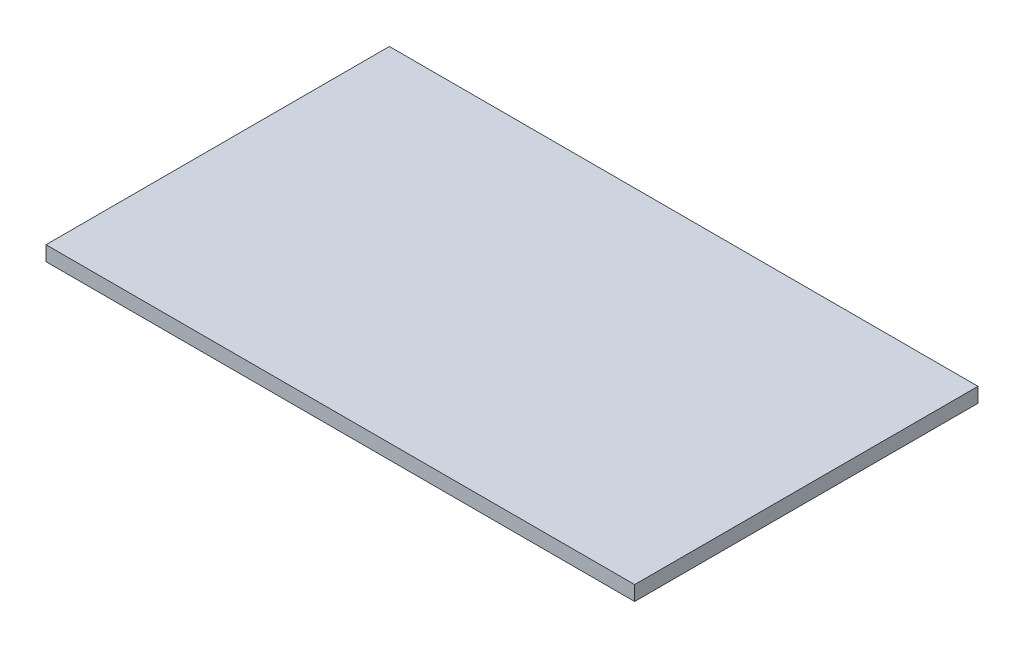
ISO-10303-21;
HEADER;
FILE_DESCRIPTION(('STEP AP214'),'2;1');
FILE_NAME('part.step','',(''),(''),'','','');
FILE_SCHEMA(('AUTOMOTIVE_DESIGN { 1 0 10303 214 1 1 1 1 }'));
ENDSEC;
DATA;
#1=APPLICATION_CONTEXT('core data for automotive mechanical design processes');
#2=APPLICATION_PROTOCOL_DEFINITION('international standard','automotive_design',2000,#1);
#3=PRODUCT_CONTEXT('',#1,'mechanical');
#4=PRODUCT('Part','Part','',(#3));
#5=PRODUCT_RELATED_PRODUCT_CATEGORY('part','',(#4));
#6=PRODUCT_DEFINITION_FORMATION('','',#4);
#7=PRODUCT_DEFINITION_CONTEXT('part definition',#1,'design');
#8=PRODUCT_DEFINITION('design','',#6,#7);
#9=PRODUCT_DEFINITION_SHAPE('','',#8);
#10=(LENGTH_UNIT() NAMED_UNIT(*) SI_UNIT(.MILLI.,.METRE.));
#11=(NAMED_UNIT(*) PLANE_ANGLE_UNIT() SI_UNIT($,.RADIAN.));
#12=(NAMED_UNIT(*) SI_UNIT($,.STERADIAN.) SOLID_ANGLE_UNIT());
#13=UNCERTAINTY_MEASURE_WITH_UNIT(LENGTH_MEASURE(1.E-05),#10,'distance_accuracy_value','');
#14=(GEOMETRIC_REPRESENTATION_CONTEXT(3) GLOBAL_UNCERTAINTY_ASSIGNED_CONTEXT((#13)) GLOBAL_UNIT_ASSIGNED_CONTEXT((#10,
#11,#12)) REPRESENTATION_CONTEXT('',''));
#15=CARTESIAN_POINT('',(0.,0.,0.));
#16=DIRECTION('',(0.,0.,1.));
#17=DIRECTION('',(1.,0.,0.));
#18=AXIS2_PLACEMENT_3D('',#15,#16,#17);
#19=CARTESIAN_POINT('',(0.,15.24,-355.6));
#20=DIRECTION('',(1.,0.,0.));
#21=DIRECTION('',(0.,0.,-1.));
#22=AXIS2_PLACEMENT_3D('',#19,#20,#21);
#23=PLANE('',#22);
#24=DIRECTION('',(0.,0.,1.));
#25=VECTOR('',#24,1.);
#26=CARTESIAN_POINT('',(0.,0.,-355.6));
#27=LINE('',#26,#25);
#28=CARTESIAN_POINT('',(0.,0.,-355.6));
#29=VERTEX_POINT('',#28);
#30=CARTESIAN_POINT('',(0.,0.,0.));
#31=VERTEX_POINT('',#30);
#32=EDGE_CURVE('E95',#29,#31,#27,.T.);
#33=ORIENTED_EDGE('',*,*,#32,.T.);
#34=DIRECTION('',(0.,-1.,0.));
#35=VECTOR('',#34,1.);
#36=CARTESIAN_POINT('',(0.,15.24,0.));
#37=LINE('',#36,#35);
#38=CARTESIAN_POINT('',(0.,15.24,0.));
#39=VERTEX_POINT('',#38);
#40=EDGE_CURVE('E11',#39,#31,#37,.T.);
#41=ORIENTED_EDGE('',*,*,#40,.F.);
#42=DIRECTION('',(0.,0.,1.));
#43=VECTOR('',#42,1.);
#44=CARTESIAN_POINT('',(0.,15.24,-355.6));
#45=LINE('',#44,#43);
#46=CARTESIAN_POINT('',(0.,15.24,-355.6));
#47=VERTEX_POINT('',#46);
#48=EDGE_CURVE('E83',#47,#39,#45,.T.);
#49=ORIENTED_EDGE('',*,*,#48,.F.);
#50=DIRECTION('',(0.,-1.,0.));
#51=VECTOR('',#50,1.);
#52=CARTESIAN_POINT('',(0.,15.24,-355.6));
#53=LINE('',#52,#51);
#54=EDGE_CURVE('E91',#47,#29,#53,.T.);
#55=ORIENTED_EDGE('',*,*,#54,.T.);
#56=EDGE_LOOP('',(#33,#41,#49,#55));
#57=FACE_BOUND('',#56,.T.);
#58=ADVANCED_FACE('F32',(#57),#23,.F.);
#59=CARTESIAN_POINT('',(0.,15.24,0.));
#60=DIRECTION('',(0.,0.,-1.));
#61=DIRECTION('',(-1.,0.,0.));
#62=AXIS2_PLACEMENT_3D('',#59,#60,#61);
#63=PLANE('',#62);
#64=DIRECTION('',(1.,0.,0.));
#65=VECTOR('',#64,1.);
#66=CARTESIAN_POINT('',(0.,0.,0.));
#67=LINE('',#66,#65);
#68=CARTESIAN_POINT('',(609.6,0.,0.));
#69=VERTEX_POINT('',#68);
#70=EDGE_CURVE('E87',#31,#69,#67,.T.);
#71=ORIENTED_EDGE('',*,*,#70,.T.);
#72=DIRECTION('',(0.,-1.,0.));
#73=VECTOR('',#72,1.);
#74=CARTESIAN_POINT('',(609.6,15.24,0.));
#75=LINE('',#74,#73);
#76=CARTESIAN_POINT('',(609.6,15.24,0.));
#77=VERTEX_POINT('',#76);
#78=EDGE_CURVE('E40',#77,#69,#75,.T.);
#79=ORIENTED_EDGE('',*,*,#78,.F.);
#80=DIRECTION('',(1.,0.,0.));
#81=VECTOR('',#80,1.);
#82=CARTESIAN_POINT('',(0.,15.24,0.));
#83=LINE('',#82,#81);
#84=EDGE_CURVE('E78',#39,#77,#83,.T.);
#85=ORIENTED_EDGE('',*,*,#84,.F.);
#86=ORIENTED_EDGE('',*,*,#40,.T.);
#87=EDGE_LOOP('',(#71,#79,#85,#86));
#88=FACE_BOUND('',#87,.T.);
#89=ADVANCED_FACE('F86',(#88),#63,.F.);
#90=CARTESIAN_POINT('',(609.6,15.24,0.));
#91=DIRECTION('',(-1.,0.,0.));
#92=DIRECTION('',(0.,0.,1.));
#93=AXIS2_PLACEMENT_3D('',#90,#91,#92);
#94=PLANE('',#93);
#95=DIRECTION('',(0.,0.,-1.));
#96=VECTOR('',#95,1.);
#97=CARTESIAN_POINT('',(609.6,0.,0.));
#98=LINE('',#97,#96);
#99=CARTESIAN_POINT('',(609.6,0.,-355.6));
#100=VERTEX_POINT('',#99);
#101=EDGE_CURVE('E65',#69,#100,#98,.T.);
#102=ORIENTED_EDGE('',*,*,#101,.T.);
#103=DIRECTION('',(0.,-1.,0.));
#104=VECTOR('',#103,1.);
#105=CARTESIAN_POINT('',(609.6,15.24,-355.6));
#106=LINE('',#105,#104);
#107=CARTESIAN_POINT('',(609.6,15.24,-355.6));
#108=VERTEX_POINT('',#107);
#109=EDGE_CURVE('E88',#108,#100,#106,.T.);
#110=ORIENTED_EDGE('',*,*,#109,.F.);
#111=DIRECTION('',(0.,0.,-1.));
#112=VECTOR('',#111,1.);
#113=CARTESIAN_POINT('',(609.6,15.24,0.));
#114=LINE('',#113,#112);
#115=EDGE_CURVE('E81',#77,#108,#114,.T.);
#116=ORIENTED_EDGE('',*,*,#115,.F.);
#117=ORIENTED_EDGE('',*,*,#78,.T.);
#118=EDGE_LOOP('',(#102,#110,#116,#117));
#119=FACE_BOUND('',#118,.T.);
#120=ADVANCED_FACE('F89',(#119),#94,.F.);
#121=CARTESIAN_POINT('',(609.6,15.24,-355.6));
#122=DIRECTION('',(0.,0.,1.));
#123=DIRECTION('',(1.,0.,0.));
#124=AXIS2_PLACEMENT_3D('',#121,#122,#123);
#125=PLANE('',#124);
#126=DIRECTION('',(-1.,0.,0.));
#127=VECTOR('',#126,1.);
#128=CARTESIAN_POINT('',(609.6,0.,-355.6));
#129=LINE('',#128,#127);
#130=EDGE_CURVE('E71',#100,#29,#129,.T.);
#131=ORIENTED_EDGE('',*,*,#130,.T.);
#132=ORIENTED_EDGE('',*,*,#54,.F.);
#133=DIRECTION('',(-1.,0.,0.));
#134=VECTOR('',#133,1.);
#135=CARTESIAN_POINT('',(609.6,15.24,-355.6));
#136=LINE('',#135,#134);
#137=EDGE_CURVE('E48',#108,#47,#136,.T.);
#138=ORIENTED_EDGE('',*,*,#137,.F.);
#139=ORIENTED_EDGE('',*,*,#109,.T.);
#140=EDGE_LOOP('',(#131,#132,#138,#139));
#141=FACE_BOUND('',#140,.T.);
#142=ADVANCED_FACE('F102',(#141),#125,.F.);
#143=CARTESIAN_POINT('',(0.,15.24,0.));
#144=DIRECTION('',(0.,1.,0.));
#145=DIRECTION('',(0.,0.,1.));
#146=AXIS2_PLACEMENT_3D('',#143,#144,#145);
#147=PLANE('',#146);
#148=ORIENTED_EDGE('',*,*,#48,.T.);
#149=ORIENTED_EDGE('',*,*,#84,.T.);
#150=ORIENTED_EDGE('',*,*,#115,.T.);
#151=ORIENTED_EDGE('',*,*,#137,.T.);
#152=EDGE_LOOP('',(#148,#149,#150,#151));
#153=FACE_BOUND('',#152,.T.);
#154=ADVANCED_FACE('F79',(#153),#147,.T.);
#155=CARTESIAN_POINT('',(0.,0.,0.));
#156=DIRECTION('',(0.,1.,0.));
#157=DIRECTION('',(0.,0.,1.));
#158=AXIS2_PLACEMENT_3D('',#155,#156,#157);
#159=PLANE('',#158);
#160=ORIENTED_EDGE('',*,*,#32,.F.);
#161=ORIENTED_EDGE('',*,*,#130,.F.);
#162=ORIENTED_EDGE('',*,*,#101,.F.);
#163=ORIENTED_EDGE('',*,*,#70,.F.);
#164=EDGE_LOOP('',(#160,#161,#162,#163));
#165=FACE_BOUND('',#164,.T.);
#166=ADVANCED_FACE('F105',(#165),#159,.F.);
#167=CLOSED_SHELL('',(#58,#89,#120,#142,#154,#166));
#168=MANIFOLD_SOLID_BREP('B2',#167);
#169=ADVANCED_BREP_SHAPE_REPRESENTATION('',(#18,#168),#14);
#170=SHAPE_DEFINITION_REPRESENTATION(#9,#169);
ENDSEC;
END-ISO-10303-21;
